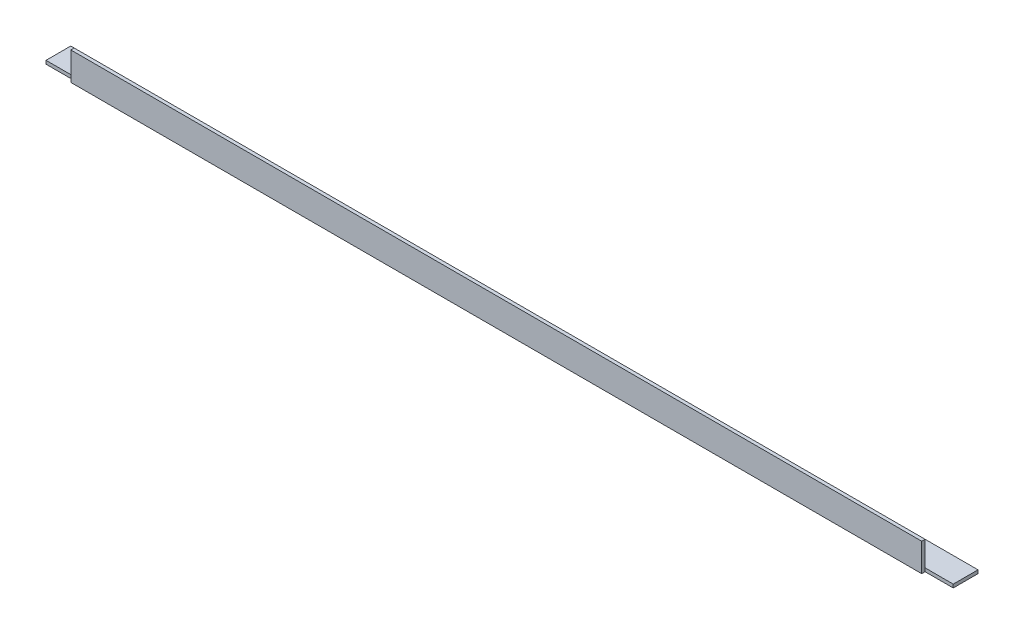
ISO-10303-21;
HEADER;
FILE_DESCRIPTION(('STEP AP214'),'2;1');
FILE_NAME('part.step','',(''),(''),'','','');
FILE_SCHEMA(('AUTOMOTIVE_DESIGN { 1 0 10303 214 1 1 1 1 }'));
ENDSEC;
DATA;
#1=APPLICATION_CONTEXT('core data for automotive mechanical design processes');
#2=APPLICATION_PROTOCOL_DEFINITION('international standard','automotive_design',2000,#1);
#3=PRODUCT_CONTEXT('',#1,'mechanical');
#4=PRODUCT('Part','Part','',(#3));
#5=PRODUCT_RELATED_PRODUCT_CATEGORY('part','',(#4));
#6=PRODUCT_DEFINITION_FORMATION('','',#4);
#7=PRODUCT_DEFINITION_CONTEXT('part definition',#1,'design');
#8=PRODUCT_DEFINITION('design','',#6,#7);
#9=PRODUCT_DEFINITION_SHAPE('','',#8);
#10=(LENGTH_UNIT() NAMED_UNIT(*) SI_UNIT(.MILLI.,.METRE.));
#11=(NAMED_UNIT(*) PLANE_ANGLE_UNIT() SI_UNIT($,.RADIAN.));
#12=(NAMED_UNIT(*) SI_UNIT($,.STERADIAN.) SOLID_ANGLE_UNIT());
#13=UNCERTAINTY_MEASURE_WITH_UNIT(LENGTH_MEASURE(1.E-05),#10,'distance_accuracy_value','');
#14=(GEOMETRIC_REPRESENTATION_CONTEXT(3) GLOBAL_UNCERTAINTY_ASSIGNED_CONTEXT((#13)) GLOBAL_UNIT_ASSIGNED_CONTEXT((#10,
#11,#12)) REPRESENTATION_CONTEXT('',''));
#15=CARTESIAN_POINT('',(0.,0.,0.));
#16=DIRECTION('',(0.,0.,1.));
#17=DIRECTION('',(1.,0.,0.));
#18=AXIS2_PLACEMENT_3D('',#15,#16,#17);
#19=CARTESIAN_POINT('',(806.,0.,0.));
#20=DIRECTION('',(0.,1.,0.));
#21=DIRECTION('',(0.,0.,1.));
#22=AXIS2_PLACEMENT_3D('',#19,#20,#21);
#23=PLANE('',#22);
#24=DIRECTION('',(-1.,0.,0.));
#25=VECTOR('',#24,1.);
#26=CARTESIAN_POINT('',(806.,0.,0.));
#27=LINE('',#26,#25);
#28=CARTESIAN_POINT('',(781.,0.,0.));
#29=VERTEX_POINT('',#28);
#30=CARTESIAN_POINT('',(25.,0.,0.));
#31=VERTEX_POINT('',#30);
#32=EDGE_CURVE('E107',#29,#31,#27,.T.);
#33=ORIENTED_EDGE('',*,*,#32,.T.);
#34=DIRECTION('',(0.,0.,1.));
#35=VECTOR('',#34,1.);
#36=CARTESIAN_POINT('',(25.,0.,0.));
#37=LINE('',#36,#35);
#38=CARTESIAN_POINT('',(25.,0.,-3.));
#39=VERTEX_POINT('',#38);
#40=EDGE_CURVE('E184',#39,#31,#37,.T.);
#41=ORIENTED_EDGE('',*,*,#40,.F.);
#42=DIRECTION('',(1.,0.,0.));
#43=VECTOR('',#42,1.);
#44=CARTESIAN_POINT('',(0.,0.,-3.));
#45=LINE('',#44,#43);
#46=CARTESIAN_POINT('',(0.,0.,-3.));
#47=VERTEX_POINT('',#46);
#48=EDGE_CURVE('E187',#47,#39,#45,.T.);
#49=ORIENTED_EDGE('',*,*,#48,.F.);
#50=DIRECTION('',(0.,0.,-1.));
#51=VECTOR('',#50,1.);
#52=CARTESIAN_POINT('',(0.,0.,0.));
#53=LINE('',#52,#51);
#54=CARTESIAN_POINT('',(0.,0.,-25.));
#55=VERTEX_POINT('',#54);
#56=EDGE_CURVE('E96',#47,#55,#53,.T.);
#57=ORIENTED_EDGE('',*,*,#56,.T.);
#58=DIRECTION('',(-1.,0.,0.));
#59=VECTOR('',#58,1.);
#60=CARTESIAN_POINT('',(806.,0.,-25.));
#61=LINE('',#60,#59);
#62=CARTESIAN_POINT('',(806.,0.,-25.));
#63=VERTEX_POINT('',#62);
#64=EDGE_CURVE('E122',#63,#55,#61,.T.);
#65=ORIENTED_EDGE('',*,*,#64,.F.);
#66=DIRECTION('',(0.,0.,-1.));
#67=VECTOR('',#66,1.);
#68=CARTESIAN_POINT('',(806.,0.,0.));
#69=LINE('',#68,#67);
#70=CARTESIAN_POINT('',(806.,0.,-3.));
#71=VERTEX_POINT('',#70);
#72=EDGE_CURVE('E99',#71,#63,#69,.T.);
#73=ORIENTED_EDGE('',*,*,#72,.F.);
#74=DIRECTION('',(1.,0.,0.));
#75=VECTOR('',#74,1.);
#76=CARTESIAN_POINT('',(806.,0.,-3.));
#77=LINE('',#76,#75);
#78=CARTESIAN_POINT('',(781.,0.,-3.));
#79=VERTEX_POINT('',#78);
#80=EDGE_CURVE('E48',#79,#71,#77,.T.);
#81=ORIENTED_EDGE('',*,*,#80,.F.);
#82=DIRECTION('',(0.,0.,-1.));
#83=VECTOR('',#82,1.);
#84=CARTESIAN_POINT('',(781.,0.,0.));
#85=LINE('',#84,#83);
#86=EDGE_CURVE('E87',#29,#79,#85,.T.);
#87=ORIENTED_EDGE('',*,*,#86,.F.);
#88=EDGE_LOOP('',(#33,#41,#49,#57,#65,#73,#81,#87));
#89=FACE_BOUND('',#88,.T.);
#90=ADVANCED_FACE('F34',(#89),#23,.F.);
#91=CARTESIAN_POINT('',(806.,3.,-25.));
#92=DIRECTION('',(0.,0.,-1.));
#93=DIRECTION('',(-1.,0.,0.));
#94=AXIS2_PLACEMENT_3D('',#91,#92,#93);
#95=PLANE('',#94);
#96=DIRECTION('',(0.,-1.,0.));
#97=VECTOR('',#96,1.);
#98=CARTESIAN_POINT('',(0.,3.,-25.));
#99=LINE('',#98,#97);
#100=CARTESIAN_POINT('',(0.,3.,-25.));
#101=VERTEX_POINT('',#100);
#102=EDGE_CURVE('E100',#101,#55,#99,.T.);
#103=ORIENTED_EDGE('',*,*,#102,.F.);
#104=DIRECTION('',(-1.,0.,0.));
#105=VECTOR('',#104,1.);
#106=CARTESIAN_POINT('',(806.,3.,-25.));
#107=LINE('',#106,#105);
#108=CARTESIAN_POINT('',(806.,3.,-25.));
#109=VERTEX_POINT('',#108);
#110=EDGE_CURVE('E57',#109,#101,#107,.T.);
#111=ORIENTED_EDGE('',*,*,#110,.F.);
#112=DIRECTION('',(0.,-1.,0.));
#113=VECTOR('',#112,1.);
#114=CARTESIAN_POINT('',(806.,3.,-25.));
#115=LINE('',#114,#113);
#116=EDGE_CURVE('E102',#109,#63,#115,.T.);
#117=ORIENTED_EDGE('',*,*,#116,.T.);
#118=ORIENTED_EDGE('',*,*,#64,.T.);
#119=EDGE_LOOP('',(#103,#111,#117,#118));
#120=FACE_BOUND('',#119,.T.);
#121=ADVANCED_FACE('F133',(#120),#95,.T.);
#122=CARTESIAN_POINT('',(806.,3.,0.));
#123=DIRECTION('',(0.,1.,0.));
#124=DIRECTION('',(0.,0.,1.));
#125=AXIS2_PLACEMENT_3D('',#122,#123,#124);
#126=PLANE('',#125);
#127=DIRECTION('',(0.,0.,-1.));
#128=VECTOR('',#127,1.);
#129=CARTESIAN_POINT('',(0.,3.,0.));
#130=LINE('',#129,#128);
#131=CARTESIAN_POINT('',(0.,3.,-3.));
#132=VERTEX_POINT('',#131);
#133=EDGE_CURVE('E95',#132,#101,#130,.T.);
#134=ORIENTED_EDGE('',*,*,#133,.F.);
#135=DIRECTION('',(-1.,0.,0.));
#136=VECTOR('',#135,1.);
#137=CARTESIAN_POINT('',(806.,3.,-3.));
#138=LINE('',#137,#136);
#139=CARTESIAN_POINT('',(25.,3.,-3.));
#140=VERTEX_POINT('',#139);
#141=EDGE_CURVE('E73',#140,#132,#138,.T.);
#142=ORIENTED_EDGE('',*,*,#141,.F.);
#143=DIRECTION('',(-1.,0.,0.));
#144=VECTOR('',#143,1.);
#145=CARTESIAN_POINT('',(806.,3.,-3.));
#146=LINE('',#145,#144);
#147=CARTESIAN_POINT('',(781.,3.,-3.));
#148=VERTEX_POINT('',#147);
#149=EDGE_CURVE('E117',#148,#140,#146,.T.);
#150=ORIENTED_EDGE('',*,*,#149,.F.);
#151=CARTESIAN_POINT('',(806.,3.,-3.));
#152=VERTEX_POINT('',#151);
#153=EDGE_CURVE('E118',#152,#148,#146,.T.);
#154=ORIENTED_EDGE('',*,*,#153,.F.);
#155=DIRECTION('',(0.,0.,-1.));
#156=VECTOR('',#155,1.);
#157=CARTESIAN_POINT('',(806.,3.,0.));
#158=LINE('',#157,#156);
#159=EDGE_CURVE('E111',#152,#109,#158,.T.);
#160=ORIENTED_EDGE('',*,*,#159,.T.);
#161=ORIENTED_EDGE('',*,*,#110,.T.);
#162=EDGE_LOOP('',(#134,#142,#150,#154,#160,#161));
#163=FACE_BOUND('',#162,.T.);
#164=ADVANCED_FACE('F97',(#163),#126,.T.);
#165=CARTESIAN_POINT('',(806.,25.,-3.));
#166=DIRECTION('',(0.,0.,-1.));
#167=DIRECTION('',(0.,1.,0.));
#168=AXIS2_PLACEMENT_3D('',#165,#166,#167);
#169=PLANE('',#168);
#170=DIRECTION('',(0.,-1.,0.));
#171=VECTOR('',#170,1.);
#172=CARTESIAN_POINT('',(25.,25.,-3.));
#173=LINE('',#172,#171);
#174=CARTESIAN_POINT('',(25.,25.,-3.));
#175=VERTEX_POINT('',#174);
#176=EDGE_CURVE('E181',#175,#140,#173,.T.);
#177=ORIENTED_EDGE('',*,*,#176,.F.);
#178=DIRECTION('',(-1.,0.,0.));
#179=VECTOR('',#178,1.);
#180=CARTESIAN_POINT('',(806.,25.,-3.));
#181=LINE('',#180,#179);
#182=CARTESIAN_POINT('',(781.,25.,-3.));
#183=VERTEX_POINT('',#182);
#184=EDGE_CURVE('E114',#183,#175,#181,.T.);
#185=ORIENTED_EDGE('',*,*,#184,.F.);
#186=DIRECTION('',(0.,-1.,0.));
#187=VECTOR('',#186,1.);
#188=CARTESIAN_POINT('',(781.,25.,-3.));
#189=LINE('',#188,#187);
#190=EDGE_CURVE('E137',#183,#148,#189,.T.);
#191=ORIENTED_EDGE('',*,*,#190,.T.);
#192=ORIENTED_EDGE('',*,*,#149,.T.);
#193=EDGE_LOOP('',(#177,#185,#191,#192));
#194=FACE_BOUND('',#193,.T.);
#195=ADVANCED_FACE('F200',(#194),#169,.T.);
#196=CARTESIAN_POINT('',(806.,25.,0.));
#197=DIRECTION('',(0.,1.,0.));
#198=DIRECTION('',(0.,0.,1.));
#199=AXIS2_PLACEMENT_3D('',#196,#197,#198);
#200=PLANE('',#199);
#201=DIRECTION('',(0.,0.,1.));
#202=VECTOR('',#201,1.);
#203=CARTESIAN_POINT('',(25.,25.,0.));
#204=LINE('',#203,#202);
#205=CARTESIAN_POINT('',(25.,25.,0.));
#206=VERTEX_POINT('',#205);
#207=EDGE_CURVE('E186',#175,#206,#204,.T.);
#208=ORIENTED_EDGE('',*,*,#207,.T.);
#209=DIRECTION('',(-1.,0.,0.));
#210=VECTOR('',#209,1.);
#211=CARTESIAN_POINT('',(806.,25.,0.));
#212=LINE('',#211,#210);
#213=CARTESIAN_POINT('',(781.,25.,0.));
#214=VERTEX_POINT('',#213);
#215=EDGE_CURVE('E110',#214,#206,#212,.T.);
#216=ORIENTED_EDGE('',*,*,#215,.F.);
#217=DIRECTION('',(0.,0.,-1.));
#218=VECTOR('',#217,1.);
#219=CARTESIAN_POINT('',(781.,25.,0.));
#220=LINE('',#219,#218);
#221=EDGE_CURVE('E149',#214,#183,#220,.T.);
#222=ORIENTED_EDGE('',*,*,#221,.T.);
#223=ORIENTED_EDGE('',*,*,#184,.T.);
#224=EDGE_LOOP('',(#208,#216,#222,#223));
#225=FACE_BOUND('',#224,.T.);
#226=ADVANCED_FACE('F201',(#225),#200,.T.);
#227=CARTESIAN_POINT('',(806.,25.,0.));
#228=DIRECTION('',(0.,0.,-1.));
#229=DIRECTION('',(0.,1.,0.));
#230=AXIS2_PLACEMENT_3D('',#227,#228,#229);
#231=PLANE('',#230);
#232=ORIENTED_EDGE('',*,*,#215,.T.);
#233=DIRECTION('',(0.,-1.,0.));
#234=VECTOR('',#233,1.);
#235=CARTESIAN_POINT('',(25.,25.,0.));
#236=LINE('',#235,#234);
#237=EDGE_CURVE('E88',#206,#31,#236,.T.);
#238=ORIENTED_EDGE('',*,*,#237,.T.);
#239=ORIENTED_EDGE('',*,*,#32,.F.);
#240=DIRECTION('',(0.,-1.,0.));
#241=VECTOR('',#240,1.);
#242=CARTESIAN_POINT('',(781.,25.,0.));
#243=LINE('',#242,#241);
#244=EDGE_CURVE('E145',#214,#29,#243,.T.);
#245=ORIENTED_EDGE('',*,*,#244,.F.);
#246=EDGE_LOOP('',(#232,#238,#239,#245));
#247=FACE_BOUND('',#246,.T.);
#248=ADVANCED_FACE('F171',(#247),#231,.F.);
#249=CARTESIAN_POINT('',(806.,0.,0.));
#250=DIRECTION('',(-1.,0.,0.));
#251=DIRECTION('',(0.,0.,1.));
#252=AXIS2_PLACEMENT_3D('',#249,#250,#251);
#253=PLANE('',#252);
#254=ORIENTED_EDGE('',*,*,#159,.F.);
#255=DIRECTION('',(0.,-1.,0.));
#256=VECTOR('',#255,1.);
#257=CARTESIAN_POINT('',(806.,0.,-3.));
#258=LINE('',#257,#256);
#259=EDGE_CURVE('E41',#152,#71,#258,.T.);
#260=ORIENTED_EDGE('',*,*,#259,.T.);
#261=ORIENTED_EDGE('',*,*,#72,.T.);
#262=ORIENTED_EDGE('',*,*,#116,.F.);
#263=EDGE_LOOP('',(#254,#260,#261,#262));
#264=FACE_BOUND('',#263,.T.);
#265=ADVANCED_FACE('F127',(#264),#253,.F.);
#266=CARTESIAN_POINT('',(0.,0.,0.));
#267=DIRECTION('',(-1.,0.,0.));
#268=DIRECTION('',(0.,0.,1.));
#269=AXIS2_PLACEMENT_3D('',#266,#267,#268);
#270=PLANE('',#269);
#271=DIRECTION('',(0.,-1.,0.));
#272=VECTOR('',#271,1.);
#273=CARTESIAN_POINT('',(0.,0.,-3.));
#274=LINE('',#273,#272);
#275=EDGE_CURVE('E11',#132,#47,#274,.T.);
#276=ORIENTED_EDGE('',*,*,#275,.F.);
#277=ORIENTED_EDGE('',*,*,#133,.T.);
#278=ORIENTED_EDGE('',*,*,#102,.T.);
#279=ORIENTED_EDGE('',*,*,#56,.F.);
#280=EDGE_LOOP('',(#276,#277,#278,#279));
#281=FACE_BOUND('',#280,.T.);
#282=ADVANCED_FACE('F93',(#281),#270,.T.);
#283=CARTESIAN_POINT('',(806.,25.,-3.));
#284=DIRECTION('',(0.,0.,-1.));
#285=DIRECTION('',(-1.,0.,0.));
#286=AXIS2_PLACEMENT_3D('',#283,#284,#285);
#287=PLANE('',#286);
#288=ORIENTED_EDGE('',*,*,#153,.T.);
#289=EDGE_CURVE('E139',#148,#79,#189,.T.);
#290=ORIENTED_EDGE('',*,*,#289,.T.);
#291=ORIENTED_EDGE('',*,*,#80,.T.);
#292=ORIENTED_EDGE('',*,*,#259,.F.);
#293=EDGE_LOOP('',(#288,#290,#291,#292));
#294=FACE_BOUND('',#293,.T.);
#295=ADVANCED_FACE('F199',(#294),#287,.F.);
#296=CARTESIAN_POINT('',(781.,25.,0.));
#297=DIRECTION('',(-1.,0.,0.));
#298=DIRECTION('',(0.,0.,1.));
#299=AXIS2_PLACEMENT_3D('',#296,#297,#298);
#300=PLANE('',#299);
#301=ORIENTED_EDGE('',*,*,#86,.T.);
#302=ORIENTED_EDGE('',*,*,#289,.F.);
#303=ORIENTED_EDGE('',*,*,#190,.F.);
#304=ORIENTED_EDGE('',*,*,#221,.F.);
#305=ORIENTED_EDGE('',*,*,#244,.T.);
#306=EDGE_LOOP('',(#301,#302,#303,#304,#305));
#307=FACE_BOUND('',#306,.T.);
#308=ADVANCED_FACE('F162',(#307),#300,.F.);
#309=CARTESIAN_POINT('',(25.,25.,0.));
#310=DIRECTION('',(1.,0.,0.));
#311=DIRECTION('',(0.,0.,-1.));
#312=AXIS2_PLACEMENT_3D('',#309,#310,#311);
#313=PLANE('',#312);
#314=ORIENTED_EDGE('',*,*,#40,.T.);
#315=ORIENTED_EDGE('',*,*,#237,.F.);
#316=ORIENTED_EDGE('',*,*,#207,.F.);
#317=ORIENTED_EDGE('',*,*,#176,.T.);
#318=EDGE_CURVE('E81',#140,#39,#173,.T.);
#319=ORIENTED_EDGE('',*,*,#318,.T.);
#320=EDGE_LOOP('',(#314,#315,#316,#317,#319));
#321=FACE_BOUND('',#320,.T.);
#322=ADVANCED_FACE('F189',(#321),#313,.F.);
#323=CARTESIAN_POINT('',(0.,25.,-3.));
#324=DIRECTION('',(0.,0.,-1.));
#325=DIRECTION('',(-1.,0.,0.));
#326=AXIS2_PLACEMENT_3D('',#323,#324,#325);
#327=PLANE('',#326);
#328=ORIENTED_EDGE('',*,*,#141,.T.);
#329=ORIENTED_EDGE('',*,*,#275,.T.);
#330=ORIENTED_EDGE('',*,*,#48,.T.);
#331=ORIENTED_EDGE('',*,*,#318,.F.);
#332=EDGE_LOOP('',(#328,#329,#330,#331));
#333=FACE_BOUND('',#332,.T.);
#334=ADVANCED_FACE('F75',(#333),#327,.F.);
#335=CLOSED_SHELL('',(#90,#121,#164,#195,#226,#248,#265,#282,#295,#308,#322,#334));
#336=MANIFOLD_SOLID_BREP('B2',#335);
#337=ADVANCED_BREP_SHAPE_REPRESENTATION('',(#18,#336),#14);
#338=SHAPE_DEFINITION_REPRESENTATION(#9,#337);
ENDSEC;
END-ISO-10303-21;
